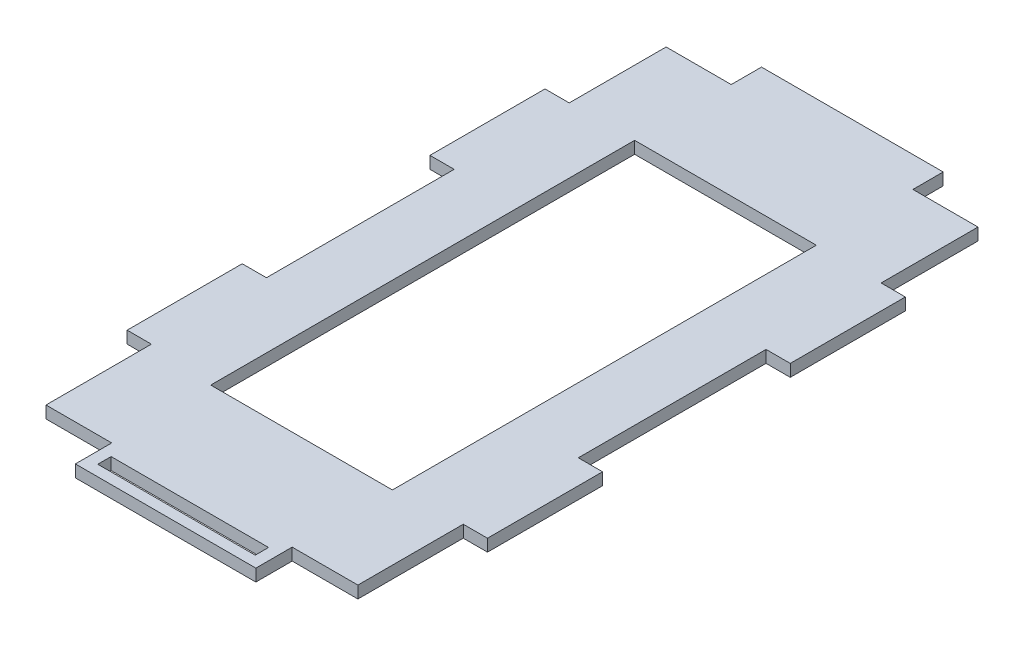
ISO-10303-21;
HEADER;
FILE_DESCRIPTION(('STEP AP214'),'2;1');
FILE_NAME('part.step','',(''),(''),'','','');
FILE_SCHEMA(('AUTOMOTIVE_DESIGN { 1 0 10303 214 1 1 1 1 }'));
ENDSEC;
DATA;
#1=APPLICATION_CONTEXT('core data for automotive mechanical design processes');
#2=APPLICATION_PROTOCOL_DEFINITION('international standard','automotive_design',2000,#1);
#3=PRODUCT_CONTEXT('',#1,'mechanical');
#4=PRODUCT('Part','Part','',(#3));
#5=PRODUCT_RELATED_PRODUCT_CATEGORY('part','',(#4));
#6=PRODUCT_DEFINITION_FORMATION('','',#4);
#7=PRODUCT_DEFINITION_CONTEXT('part definition',#1,'design');
#8=PRODUCT_DEFINITION('design','',#6,#7);
#9=PRODUCT_DEFINITION_SHAPE('','',#8);
#10=(LENGTH_UNIT() NAMED_UNIT(*) SI_UNIT(.MILLI.,.METRE.));
#11=(NAMED_UNIT(*) PLANE_ANGLE_UNIT() SI_UNIT($,.RADIAN.));
#12=(NAMED_UNIT(*) SI_UNIT($,.STERADIAN.) SOLID_ANGLE_UNIT());
#13=UNCERTAINTY_MEASURE_WITH_UNIT(LENGTH_MEASURE(1.E-05),#10,'distance_accuracy_value','');
#14=(GEOMETRIC_REPRESENTATION_CONTEXT(3) GLOBAL_UNCERTAINTY_ASSIGNED_CONTEXT((#13)) GLOBAL_UNIT_ASSIGNED_CONTEXT((#10,
#11,#12)) REPRESENTATION_CONTEXT('',''));
#15=CARTESIAN_POINT('',(0.,0.,0.));
#16=DIRECTION('',(0.,0.,1.));
#17=DIRECTION('',(1.,0.,0.));
#18=AXIS2_PLACEMENT_3D('',#15,#16,#17);
#19=CARTESIAN_POINT('',(-29.8,2.,-6.));
#20=DIRECTION('',(1.,0.,0.));
#21=DIRECTION('',(0.,0.,-1.));
#22=AXIS2_PLACEMENT_3D('',#19,#20,#21);
#23=PLANE('',#22);
#24=DIRECTION('',(0.,0.,1.));
#25=VECTOR('',#24,1.);
#26=CARTESIAN_POINT('',(-29.8,0.,-6.));
#27=LINE('',#26,#25);
#28=CARTESIAN_POINT('',(-29.8,0.,-6.));
#29=VERTEX_POINT('',#28);
#30=CARTESIAN_POINT('',(-29.8,0.,0.));
#31=VERTEX_POINT('',#30);
#32=EDGE_CURVE('E304',#29,#31,#27,.T.);
#33=ORIENTED_EDGE('',*,*,#32,.T.);
#34=DIRECTION('',(0.,-1.,0.));
#35=VECTOR('',#34,1.);
#36=CARTESIAN_POINT('',(-29.8,2.,0.));
#37=LINE('',#36,#35);
#38=CARTESIAN_POINT('',(-29.8,2.,0.));
#39=VERTEX_POINT('',#38);
#40=EDGE_CURVE('E11',#39,#31,#37,.T.);
#41=ORIENTED_EDGE('',*,*,#40,.F.);
#42=DIRECTION('',(0.,0.,1.));
#43=VECTOR('',#42,1.);
#44=CARTESIAN_POINT('',(-29.8,2.,-6.));
#45=LINE('',#44,#43);
#46=CARTESIAN_POINT('',(-29.8,2.,-6.));
#47=VERTEX_POINT('',#46);
#48=EDGE_CURVE('E333',#47,#39,#45,.T.);
#49=ORIENTED_EDGE('',*,*,#48,.F.);
#50=DIRECTION('',(0.,-1.,0.));
#51=VECTOR('',#50,1.);
#52=CARTESIAN_POINT('',(-29.8,2.,-6.));
#53=LINE('',#52,#51);
#54=EDGE_CURVE('E391',#47,#29,#53,.T.);
#55=ORIENTED_EDGE('',*,*,#54,.T.);
#56=EDGE_LOOP('',(#33,#41,#49,#55));
#57=FACE_BOUND('',#56,.T.);
#58=ADVANCED_FACE('F37',(#57),#23,.F.);
#59=CARTESIAN_POINT('',(-29.8,2.,0.));
#60=DIRECTION('',(0.,0.,-1.));
#61=DIRECTION('',(-1.,0.,0.));
#62=AXIS2_PLACEMENT_3D('',#59,#60,#61);
#63=PLANE('',#62);
#64=DIRECTION('',(1.,0.,0.));
#65=VECTOR('',#64,1.);
#66=CARTESIAN_POINT('',(-29.8,0.,0.));
#67=LINE('',#66,#65);
#68=CARTESIAN_POINT('',(0.,0.,0.));
#69=VERTEX_POINT('',#68);
#70=EDGE_CURVE('E394',#31,#69,#67,.T.);
#71=ORIENTED_EDGE('',*,*,#70,.T.);
#72=DIRECTION('',(0.,-1.,0.));
#73=VECTOR('',#72,1.);
#74=CARTESIAN_POINT('',(0.,2.,0.));
#75=LINE('',#74,#73);
#76=CARTESIAN_POINT('',(0.,2.,0.));
#77=VERTEX_POINT('',#76);
#78=EDGE_CURVE('E44',#77,#69,#75,.T.);
#79=ORIENTED_EDGE('',*,*,#78,.F.);
#80=DIRECTION('',(1.,0.,0.));
#81=VECTOR('',#80,1.);
#82=CARTESIAN_POINT('',(-29.8,2.,0.));
#83=LINE('',#82,#81);
#84=EDGE_CURVE('E336',#39,#77,#83,.T.);
#85=ORIENTED_EDGE('',*,*,#84,.F.);
#86=ORIENTED_EDGE('',*,*,#40,.T.);
#87=EDGE_LOOP('',(#71,#79,#85,#86));
#88=FACE_BOUND('',#87,.T.);
#89=ADVANCED_FACE('F550',(#88),#63,.F.);
#90=CARTESIAN_POINT('',(0.,2.,0.));
#91=DIRECTION('',(-1.,0.,0.));
#92=DIRECTION('',(0.,0.,1.));
#93=AXIS2_PLACEMENT_3D('',#90,#91,#92);
#94=PLANE('',#93);
#95=DIRECTION('',(0.,0.,-1.));
#96=VECTOR('',#95,1.);
#97=CARTESIAN_POINT('',(0.,0.,0.));
#98=LINE('',#97,#96);
#99=CARTESIAN_POINT('',(0.,0.,-6.));
#100=VERTEX_POINT('',#99);
#101=EDGE_CURVE('E396',#69,#100,#98,.T.);
#102=ORIENTED_EDGE('',*,*,#101,.T.);
#103=DIRECTION('',(0.,-1.,0.));
#104=VECTOR('',#103,1.);
#105=CARTESIAN_POINT('',(0.,2.,-6.));
#106=LINE('',#105,#104);
#107=CARTESIAN_POINT('',(0.,2.,-6.));
#108=VERTEX_POINT('',#107);
#109=EDGE_CURVE('E521',#108,#100,#106,.T.);
#110=ORIENTED_EDGE('',*,*,#109,.F.);
#111=DIRECTION('',(0.,0.,-1.));
#112=VECTOR('',#111,1.);
#113=CARTESIAN_POINT('',(0.,2.,0.));
#114=LINE('',#113,#112);
#115=EDGE_CURVE('E339',#77,#108,#114,.T.);
#116=ORIENTED_EDGE('',*,*,#115,.F.);
#117=ORIENTED_EDGE('',*,*,#78,.T.);
#118=EDGE_LOOP('',(#102,#110,#116,#117));
#119=FACE_BOUND('',#118,.T.);
#120=ADVANCED_FACE('F528',(#119),#94,.F.);
#121=CARTESIAN_POINT('',(0.,2.,-6.));
#122=DIRECTION('',(0.,0.,-1.));
#123=DIRECTION('',(-1.,0.,0.));
#124=AXIS2_PLACEMENT_3D('',#121,#122,#123);
#125=PLANE('',#124);
#126=DIRECTION('',(1.,0.,0.));
#127=VECTOR('',#126,1.);
#128=CARTESIAN_POINT('',(0.,0.,-6.));
#129=LINE('',#128,#127);
#130=CARTESIAN_POINT('',(10.85,0.,-6.));
#131=VERTEX_POINT('',#130);
#132=EDGE_CURVE('E398',#100,#131,#129,.T.);
#133=ORIENTED_EDGE('',*,*,#132,.T.);
#134=DIRECTION('',(0.,-1.,0.));
#135=VECTOR('',#134,1.);
#136=CARTESIAN_POINT('',(10.85,2.,-6.));
#137=LINE('',#136,#135);
#138=CARTESIAN_POINT('',(10.85,2.,-6.));
#139=VERTEX_POINT('',#138);
#140=EDGE_CURVE('E518',#139,#131,#137,.T.);
#141=ORIENTED_EDGE('',*,*,#140,.F.);
#142=DIRECTION('',(1.,0.,0.));
#143=VECTOR('',#142,1.);
#144=CARTESIAN_POINT('',(0.,2.,-6.));
#145=LINE('',#144,#143);
#146=EDGE_CURVE('E341',#108,#139,#145,.T.);
#147=ORIENTED_EDGE('',*,*,#146,.F.);
#148=ORIENTED_EDGE('',*,*,#109,.T.);
#149=EDGE_LOOP('',(#133,#141,#147,#148));
#150=FACE_BOUND('',#149,.T.);
#151=ADVANCED_FACE('F539',(#150),#125,.F.);
#152=CARTESIAN_POINT('',(10.85,2.,-6.));
#153=DIRECTION('',(-1.,0.,0.));
#154=DIRECTION('',(0.,0.,1.));
#155=AXIS2_PLACEMENT_3D('',#152,#153,#154);
#156=PLANE('',#155);
#157=DIRECTION('',(0.,0.,-1.));
#158=VECTOR('',#157,1.);
#159=CARTESIAN_POINT('',(10.85,0.,-6.));
#160=LINE('',#159,#158);
#161=CARTESIAN_POINT('',(10.85,0.,-23.4));
#162=VERTEX_POINT('',#161);
#163=EDGE_CURVE('E400',#131,#162,#160,.T.);
#164=ORIENTED_EDGE('',*,*,#163,.T.);
#165=DIRECTION('',(0.,-1.,0.));
#166=VECTOR('',#165,1.);
#167=CARTESIAN_POINT('',(10.85,2.,-23.4));
#168=LINE('',#167,#166);
#169=CARTESIAN_POINT('',(10.85,2.,-23.4));
#170=VERTEX_POINT('',#169);
#171=EDGE_CURVE('E515',#170,#162,#168,.T.);
#172=ORIENTED_EDGE('',*,*,#171,.F.);
#173=DIRECTION('',(0.,0.,-1.));
#174=VECTOR('',#173,1.);
#175=CARTESIAN_POINT('',(10.85,2.,-6.));
#176=LINE('',#175,#174);
#177=EDGE_CURVE('E343',#139,#170,#176,.T.);
#178=ORIENTED_EDGE('',*,*,#177,.F.);
#179=ORIENTED_EDGE('',*,*,#140,.T.);
#180=EDGE_LOOP('',(#164,#172,#178,#179));
#181=FACE_BOUND('',#180,.T.);
#182=ADVANCED_FACE('F543',(#181),#156,.F.);
#183=CARTESIAN_POINT('',(10.85,2.,-23.4));
#184=DIRECTION('',(0.,0.,-1.));
#185=DIRECTION('',(-1.,0.,0.));
#186=AXIS2_PLACEMENT_3D('',#183,#184,#185);
#187=PLANE('',#186);
#188=DIRECTION('',(1.,0.,0.));
#189=VECTOR('',#188,1.);
#190=CARTESIAN_POINT('',(10.85,0.,-23.4));
#191=LINE('',#190,#189);
#192=CARTESIAN_POINT('',(14.85,0.,-23.4));
#193=VERTEX_POINT('',#192);
#194=EDGE_CURVE('E402',#162,#193,#191,.T.);
#195=ORIENTED_EDGE('',*,*,#194,.T.);
#196=DIRECTION('',(0.,-1.,0.));
#197=VECTOR('',#196,1.);
#198=CARTESIAN_POINT('',(14.85,2.,-23.4));
#199=LINE('',#198,#197);
#200=CARTESIAN_POINT('',(14.85,2.,-23.4));
#201=VERTEX_POINT('',#200);
#202=EDGE_CURVE('E512',#201,#193,#199,.T.);
#203=ORIENTED_EDGE('',*,*,#202,.F.);
#204=DIRECTION('',(1.,0.,0.));
#205=VECTOR('',#204,1.);
#206=CARTESIAN_POINT('',(10.85,2.,-23.4));
#207=LINE('',#206,#205);
#208=EDGE_CURVE('E345',#170,#201,#207,.T.);
#209=ORIENTED_EDGE('',*,*,#208,.F.);
#210=ORIENTED_EDGE('',*,*,#171,.T.);
#211=EDGE_LOOP('',(#195,#203,#209,#210));
#212=FACE_BOUND('',#211,.T.);
#213=ADVANCED_FACE('F663',(#212),#187,.F.);
#214=CARTESIAN_POINT('',(14.85,2.,-23.4));
#215=DIRECTION('',(-1.,0.,0.));
#216=DIRECTION('',(0.,0.,1.));
#217=AXIS2_PLACEMENT_3D('',#214,#215,#216);
#218=PLANE('',#217);
#219=DIRECTION('',(0.,0.,-1.));
#220=VECTOR('',#219,1.);
#221=CARTESIAN_POINT('',(14.85,0.,-23.4));
#222=LINE('',#221,#220);
#223=CARTESIAN_POINT('',(14.85,0.,-42.4));
#224=VERTEX_POINT('',#223);
#225=EDGE_CURVE('E404',#193,#224,#222,.T.);
#226=ORIENTED_EDGE('',*,*,#225,.T.);
#227=DIRECTION('',(0.,-1.,0.));
#228=VECTOR('',#227,1.);
#229=CARTESIAN_POINT('',(14.85,2.,-42.4));
#230=LINE('',#229,#228);
#231=CARTESIAN_POINT('',(14.85,2.,-42.4));
#232=VERTEX_POINT('',#231);
#233=EDGE_CURVE('E509',#232,#224,#230,.T.);
#234=ORIENTED_EDGE('',*,*,#233,.F.);
#235=DIRECTION('',(0.,0.,-1.));
#236=VECTOR('',#235,1.);
#237=CARTESIAN_POINT('',(14.85,2.,-23.4));
#238=LINE('',#237,#236);
#239=EDGE_CURVE('E347',#201,#232,#238,.T.);
#240=ORIENTED_EDGE('',*,*,#239,.F.);
#241=ORIENTED_EDGE('',*,*,#202,.T.);
#242=EDGE_LOOP('',(#226,#234,#240,#241));
#243=FACE_BOUND('',#242,.T.);
#244=ADVANCED_FACE('F660',(#243),#218,.F.);
#245=CARTESIAN_POINT('',(14.85,2.,-42.4));
#246=DIRECTION('',(0.,0.,1.));
#247=DIRECTION('',(1.,0.,0.));
#248=AXIS2_PLACEMENT_3D('',#245,#246,#247);
#249=PLANE('',#248);
#250=DIRECTION('',(-1.,0.,0.));
#251=VECTOR('',#250,1.);
#252=CARTESIAN_POINT('',(14.85,0.,-42.4));
#253=LINE('',#252,#251);
#254=CARTESIAN_POINT('',(10.85,0.,-42.4));
#255=VERTEX_POINT('',#254);
#256=EDGE_CURVE('E406',#224,#255,#253,.T.);
#257=ORIENTED_EDGE('',*,*,#256,.T.);
#258=DIRECTION('',(0.,-1.,0.));
#259=VECTOR('',#258,1.);
#260=CARTESIAN_POINT('',(10.85,2.,-42.4));
#261=LINE('',#260,#259);
#262=CARTESIAN_POINT('',(10.85,2.,-42.4));
#263=VERTEX_POINT('',#262);
#264=EDGE_CURVE('E506',#263,#255,#261,.T.);
#265=ORIENTED_EDGE('',*,*,#264,.F.);
#266=DIRECTION('',(-1.,0.,0.));
#267=VECTOR('',#266,1.);
#268=CARTESIAN_POINT('',(14.85,2.,-42.4));
#269=LINE('',#268,#267);
#270=EDGE_CURVE('E349',#232,#263,#269,.T.);
#271=ORIENTED_EDGE('',*,*,#270,.F.);
#272=ORIENTED_EDGE('',*,*,#233,.T.);
#273=EDGE_LOOP('',(#257,#265,#271,#272));
#274=FACE_BOUND('',#273,.T.);
#275=ADVANCED_FACE('F656',(#274),#249,.F.);
#276=CARTESIAN_POINT('',(10.85,2.,-42.4));
#277=DIRECTION('',(-1.,0.,0.));
#278=DIRECTION('',(0.,0.,1.));
#279=AXIS2_PLACEMENT_3D('',#276,#277,#278);
#280=PLANE('',#279);
#281=DIRECTION('',(0.,0.,-1.));
#282=VECTOR('',#281,1.);
#283=CARTESIAN_POINT('',(10.85,0.,-42.4));
#284=LINE('',#283,#282);
#285=CARTESIAN_POINT('',(10.85,0.,-73.4));
#286=VERTEX_POINT('',#285);
#287=EDGE_CURVE('E408',#255,#286,#284,.T.);
#288=ORIENTED_EDGE('',*,*,#287,.T.);
#289=DIRECTION('',(0.,-1.,0.));
#290=VECTOR('',#289,1.);
#291=CARTESIAN_POINT('',(10.85,2.,-73.4));
#292=LINE('',#291,#290);
#293=CARTESIAN_POINT('',(10.85,2.,-73.4));
#294=VERTEX_POINT('',#293);
#295=EDGE_CURVE('E503',#294,#286,#292,.T.);
#296=ORIENTED_EDGE('',*,*,#295,.F.);
#297=DIRECTION('',(0.,0.,-1.));
#298=VECTOR('',#297,1.);
#299=CARTESIAN_POINT('',(10.85,2.,-42.4));
#300=LINE('',#299,#298);
#301=EDGE_CURVE('E351',#263,#294,#300,.T.);
#302=ORIENTED_EDGE('',*,*,#301,.F.);
#303=ORIENTED_EDGE('',*,*,#264,.T.);
#304=EDGE_LOOP('',(#288,#296,#302,#303));
#305=FACE_BOUND('',#304,.T.);
#306=ADVANCED_FACE('F652',(#305),#280,.F.);
#307=CARTESIAN_POINT('',(10.85,2.,-73.4));
#308=DIRECTION('',(0.,0.,-1.));
#309=DIRECTION('',(-1.,0.,0.));
#310=AXIS2_PLACEMENT_3D('',#307,#308,#309);
#311=PLANE('',#310);
#312=DIRECTION('',(1.,0.,0.));
#313=VECTOR('',#312,1.);
#314=CARTESIAN_POINT('',(10.85,0.,-73.4));
#315=LINE('',#314,#313);
#316=CARTESIAN_POINT('',(14.85,0.,-73.4));
#317=VERTEX_POINT('',#316);
#318=EDGE_CURVE('E410',#286,#317,#315,.T.);
#319=ORIENTED_EDGE('',*,*,#318,.T.);
#320=DIRECTION('',(0.,-1.,0.));
#321=VECTOR('',#320,1.);
#322=CARTESIAN_POINT('',(14.85,2.,-73.4));
#323=LINE('',#322,#321);
#324=CARTESIAN_POINT('',(14.85,2.,-73.4));
#325=VERTEX_POINT('',#324);
#326=EDGE_CURVE('E500',#325,#317,#323,.T.);
#327=ORIENTED_EDGE('',*,*,#326,.F.);
#328=DIRECTION('',(1.,0.,0.));
#329=VECTOR('',#328,1.);
#330=CARTESIAN_POINT('',(10.85,2.,-73.4));
#331=LINE('',#330,#329);
#332=EDGE_CURVE('E353',#294,#325,#331,.T.);
#333=ORIENTED_EDGE('',*,*,#332,.F.);
#334=ORIENTED_EDGE('',*,*,#295,.T.);
#335=EDGE_LOOP('',(#319,#327,#333,#334));
#336=FACE_BOUND('',#335,.T.);
#337=ADVANCED_FACE('F647',(#336),#311,.F.);
#338=CARTESIAN_POINT('',(14.85,2.,-73.4));
#339=DIRECTION('',(-1.,0.,0.));
#340=DIRECTION('',(0.,0.,1.));
#341=AXIS2_PLACEMENT_3D('',#338,#339,#340);
#342=PLANE('',#341);
#343=DIRECTION('',(0.,0.,-1.));
#344=VECTOR('',#343,1.);
#345=CARTESIAN_POINT('',(14.85,0.,-73.4));
#346=LINE('',#345,#344);
#347=CARTESIAN_POINT('',(14.85,0.,-92.4));
#348=VERTEX_POINT('',#347);
#349=EDGE_CURVE('E412',#317,#348,#346,.T.);
#350=ORIENTED_EDGE('',*,*,#349,.T.);
#351=DIRECTION('',(0.,-1.,0.));
#352=VECTOR('',#351,1.);
#353=CARTESIAN_POINT('',(14.85,2.,-92.4));
#354=LINE('',#353,#352);
#355=CARTESIAN_POINT('',(14.85,2.,-92.4));
#356=VERTEX_POINT('',#355);
#357=EDGE_CURVE('E497',#356,#348,#354,.T.);
#358=ORIENTED_EDGE('',*,*,#357,.F.);
#359=DIRECTION('',(0.,0.,-1.));
#360=VECTOR('',#359,1.);
#361=CARTESIAN_POINT('',(14.85,2.,-73.4));
#362=LINE('',#361,#360);
#363=EDGE_CURVE('E355',#325,#356,#362,.T.);
#364=ORIENTED_EDGE('',*,*,#363,.F.);
#365=ORIENTED_EDGE('',*,*,#326,.T.);
#366=EDGE_LOOP('',(#350,#358,#364,#365));
#367=FACE_BOUND('',#366,.T.);
#368=ADVANCED_FACE('F641',(#367),#342,.F.);
#369=CARTESIAN_POINT('',(14.85,2.,-92.4));
#370=DIRECTION('',(0.,0.,1.));
#371=DIRECTION('',(1.,0.,0.));
#372=AXIS2_PLACEMENT_3D('',#369,#370,#371);
#373=PLANE('',#372);
#374=DIRECTION('',(-1.,0.,0.));
#375=VECTOR('',#374,1.);
#376=CARTESIAN_POINT('',(14.85,0.,-92.4));
#377=LINE('',#376,#375);
#378=CARTESIAN_POINT('',(10.85,0.,-92.4));
#379=VERTEX_POINT('',#378);
#380=EDGE_CURVE('E414',#348,#379,#377,.T.);
#381=ORIENTED_EDGE('',*,*,#380,.T.);
#382=DIRECTION('',(0.,-1.,0.));
#383=VECTOR('',#382,1.);
#384=CARTESIAN_POINT('',(10.85,2.,-92.4));
#385=LINE('',#384,#383);
#386=CARTESIAN_POINT('',(10.85,2.,-92.4));
#387=VERTEX_POINT('',#386);
#388=EDGE_CURVE('E494',#387,#379,#385,.T.);
#389=ORIENTED_EDGE('',*,*,#388,.F.);
#390=DIRECTION('',(-1.,0.,0.));
#391=VECTOR('',#390,1.);
#392=CARTESIAN_POINT('',(14.85,2.,-92.4));
#393=LINE('',#392,#391);
#394=EDGE_CURVE('E357',#356,#387,#393,.T.);
#395=ORIENTED_EDGE('',*,*,#394,.F.);
#396=ORIENTED_EDGE('',*,*,#357,.T.);
#397=EDGE_LOOP('',(#381,#389,#395,#396));
#398=FACE_BOUND('',#397,.T.);
#399=ADVANCED_FACE('F637',(#398),#373,.F.);
#400=CARTESIAN_POINT('',(10.85,2.,-92.4));
#401=DIRECTION('',(-1.,0.,0.));
#402=DIRECTION('',(0.,0.,1.));
#403=AXIS2_PLACEMENT_3D('',#400,#401,#402);
#404=PLANE('',#403);
#405=DIRECTION('',(0.,0.,-1.));
#406=VECTOR('',#405,1.);
#407=CARTESIAN_POINT('',(10.85,0.,-92.4));
#408=LINE('',#407,#406);
#409=CARTESIAN_POINT('',(10.85,0.,-108.4));
#410=VERTEX_POINT('',#409);
#411=EDGE_CURVE('E416',#379,#410,#408,.T.);
#412=ORIENTED_EDGE('',*,*,#411,.T.);
#413=DIRECTION('',(0.,-1.,0.));
#414=VECTOR('',#413,1.);
#415=CARTESIAN_POINT('',(10.85,2.,-108.4));
#416=LINE('',#415,#414);
#417=CARTESIAN_POINT('',(10.85,2.,-108.4));
#418=VERTEX_POINT('',#417);
#419=EDGE_CURVE('E491',#418,#410,#416,.T.);
#420=ORIENTED_EDGE('',*,*,#419,.F.);
#421=DIRECTION('',(0.,0.,-1.));
#422=VECTOR('',#421,1.);
#423=CARTESIAN_POINT('',(10.85,2.,-92.4));
#424=LINE('',#423,#422);
#425=EDGE_CURVE('E359',#387,#418,#424,.T.);
#426=ORIENTED_EDGE('',*,*,#425,.F.);
#427=ORIENTED_EDGE('',*,*,#388,.T.);
#428=EDGE_LOOP('',(#412,#420,#426,#427));
#429=FACE_BOUND('',#428,.T.);
#430=ADVANCED_FACE('F632',(#429),#404,.F.);
#431=CARTESIAN_POINT('',(0.0999999999999925,2.,-108.4));
#432=DIRECTION('',(0.,0.,1.));
#433=DIRECTION('',(1.,0.,0.));
#434=AXIS2_PLACEMENT_3D('',#431,#432,#433);
#435=PLANE('',#434);
#436=DIRECTION('',(-1.,0.,0.));
#437=VECTOR('',#436,1.);
#438=CARTESIAN_POINT('',(0.0999999999999925,0.,-108.4));
#439=LINE('',#438,#437);
#440=CARTESIAN_POINT('',(0.0999999999999925,0.,-108.4));
#441=VERTEX_POINT('',#440);
#442=EDGE_CURVE('E418',#410,#441,#439,.T.);
#443=ORIENTED_EDGE('',*,*,#442,.T.);
#444=DIRECTION('',(0.,-1.,0.));
#445=VECTOR('',#444,1.);
#446=CARTESIAN_POINT('',(0.0999999999999925,2.,-108.4));
#447=LINE('',#446,#445);
#448=CARTESIAN_POINT('',(0.0999999999999925,2.,-108.4));
#449=VERTEX_POINT('',#448);
#450=EDGE_CURVE('E488',#449,#441,#447,.T.);
#451=ORIENTED_EDGE('',*,*,#450,.F.);
#452=DIRECTION('',(-1.,0.,0.));
#453=VECTOR('',#452,1.);
#454=CARTESIAN_POINT('',(0.0999999999999925,2.,-108.4));
#455=LINE('',#454,#453);
#456=EDGE_CURVE('E361',#418,#449,#455,.T.);
#457=ORIENTED_EDGE('',*,*,#456,.F.);
#458=ORIENTED_EDGE('',*,*,#419,.T.);
#459=EDGE_LOOP('',(#443,#451,#457,#458));
#460=FACE_BOUND('',#459,.T.);
#461=ADVANCED_FACE('F626',(#460),#435,.F.);
#462=CARTESIAN_POINT('',(0.0999999999999925,2.,-108.4));
#463=DIRECTION('',(-1.,0.,0.));
#464=DIRECTION('',(0.,0.,1.));
#465=AXIS2_PLACEMENT_3D('',#462,#463,#464);
#466=PLANE('',#465);
#467=DIRECTION('',(0.,0.,-1.));
#468=VECTOR('',#467,1.);
#469=CARTESIAN_POINT('',(0.0999999999999925,0.,-108.4));
#470=LINE('',#469,#468);
#471=CARTESIAN_POINT('',(0.0999999999999925,0.,-113.4));
#472=VERTEX_POINT('',#471);
#473=EDGE_CURVE('E420',#441,#472,#470,.T.);
#474=ORIENTED_EDGE('',*,*,#473,.T.);
#475=DIRECTION('',(0.,-1.,0.));
#476=VECTOR('',#475,1.);
#477=CARTESIAN_POINT('',(0.0999999999999925,2.,-113.4));
#478=LINE('',#477,#476);
#479=CARTESIAN_POINT('',(0.0999999999999925,2.,-113.4));
#480=VERTEX_POINT('',#479);
#481=EDGE_CURVE('E485',#480,#472,#478,.T.);
#482=ORIENTED_EDGE('',*,*,#481,.F.);
#483=DIRECTION('',(0.,0.,-1.));
#484=VECTOR('',#483,1.);
#485=CARTESIAN_POINT('',(0.0999999999999925,2.,-108.4));
#486=LINE('',#485,#484);
#487=EDGE_CURVE('E363',#449,#480,#486,.T.);
#488=ORIENTED_EDGE('',*,*,#487,.F.);
#489=ORIENTED_EDGE('',*,*,#450,.T.);
#490=EDGE_LOOP('',(#474,#482,#488,#489));
#491=FACE_BOUND('',#490,.T.);
#492=ADVANCED_FACE('F622',(#491),#466,.F.);
#493=CARTESIAN_POINT('',(-29.9,2.,-113.4));
#494=DIRECTION('',(0.,0.,1.));
#495=DIRECTION('',(1.,0.,0.));
#496=AXIS2_PLACEMENT_3D('',#493,#494,#495);
#497=PLANE('',#496);
#498=DIRECTION('',(-1.,0.,0.));
#499=VECTOR('',#498,1.);
#500=CARTESIAN_POINT('',(-29.9,0.,-113.4));
#501=LINE('',#500,#499);
#502=CARTESIAN_POINT('',(-29.9,0.,-113.4));
#503=VERTEX_POINT('',#502);
#504=EDGE_CURVE('E422',#472,#503,#501,.T.);
#505=ORIENTED_EDGE('',*,*,#504,.T.);
#506=DIRECTION('',(0.,-1.,0.));
#507=VECTOR('',#506,1.);
#508=CARTESIAN_POINT('',(-29.9,2.,-113.4));
#509=LINE('',#508,#507);
#510=CARTESIAN_POINT('',(-29.9,2.,-113.4));
#511=VERTEX_POINT('',#510);
#512=EDGE_CURVE('E482',#511,#503,#509,.T.);
#513=ORIENTED_EDGE('',*,*,#512,.F.);
#514=DIRECTION('',(-1.,0.,0.));
#515=VECTOR('',#514,1.);
#516=CARTESIAN_POINT('',(-29.9,2.,-113.4));
#517=LINE('',#516,#515);
#518=EDGE_CURVE('E365',#480,#511,#517,.T.);
#519=ORIENTED_EDGE('',*,*,#518,.F.);
#520=ORIENTED_EDGE('',*,*,#481,.T.);
#521=EDGE_LOOP('',(#505,#513,#519,#520));
#522=FACE_BOUND('',#521,.T.);
#523=ADVANCED_FACE('F617',(#522),#497,.F.);
#524=CARTESIAN_POINT('',(-29.9,2.,-108.4));
#525=DIRECTION('',(1.,0.,0.));
#526=DIRECTION('',(0.,0.,-1.));
#527=AXIS2_PLACEMENT_3D('',#524,#525,#526);
#528=PLANE('',#527);
#529=DIRECTION('',(0.,0.,1.));
#530=VECTOR('',#529,1.);
#531=CARTESIAN_POINT('',(-29.9,0.,-108.4));
#532=LINE('',#531,#530);
#533=CARTESIAN_POINT('',(-29.9,0.,-108.4));
#534=VERTEX_POINT('',#533);
#535=EDGE_CURVE('E424',#503,#534,#532,.T.);
#536=ORIENTED_EDGE('',*,*,#535,.T.);
#537=DIRECTION('',(0.,-1.,0.));
#538=VECTOR('',#537,1.);
#539=CARTESIAN_POINT('',(-29.9,2.,-108.4));
#540=LINE('',#539,#538);
#541=CARTESIAN_POINT('',(-29.9,2.,-108.4));
#542=VERTEX_POINT('',#541);
#543=EDGE_CURVE('E479',#542,#534,#540,.T.);
#544=ORIENTED_EDGE('',*,*,#543,.F.);
#545=DIRECTION('',(0.,0.,1.));
#546=VECTOR('',#545,1.);
#547=CARTESIAN_POINT('',(-29.9,2.,-108.4));
#548=LINE('',#547,#546);
#549=EDGE_CURVE('E367',#511,#542,#548,.T.);
#550=ORIENTED_EDGE('',*,*,#549,.F.);
#551=ORIENTED_EDGE('',*,*,#512,.T.);
#552=EDGE_LOOP('',(#536,#544,#550,#551));
#553=FACE_BOUND('',#552,.T.);
#554=ADVANCED_FACE('F611',(#553),#528,.F.);
#555=CARTESIAN_POINT('',(-40.65,2.,-108.4));
#556=DIRECTION('',(0.,0.,1.));
#557=DIRECTION('',(1.,0.,0.));
#558=AXIS2_PLACEMENT_3D('',#555,#556,#557);
#559=PLANE('',#558);
#560=DIRECTION('',(-1.,0.,0.));
#561=VECTOR('',#560,1.);
#562=CARTESIAN_POINT('',(-40.65,0.,-108.4));
#563=LINE('',#562,#561);
#564=CARTESIAN_POINT('',(-40.65,0.,-108.4));
#565=VERTEX_POINT('',#564);
#566=EDGE_CURVE('E426',#534,#565,#563,.T.);
#567=ORIENTED_EDGE('',*,*,#566,.T.);
#568=DIRECTION('',(0.,-1.,0.));
#569=VECTOR('',#568,1.);
#570=CARTESIAN_POINT('',(-40.65,2.,-108.4));
#571=LINE('',#570,#569);
#572=CARTESIAN_POINT('',(-40.65,2.,-108.4));
#573=VERTEX_POINT('',#572);
#574=EDGE_CURVE('E476',#573,#565,#571,.T.);
#575=ORIENTED_EDGE('',*,*,#574,.F.);
#576=DIRECTION('',(-1.,0.,0.));
#577=VECTOR('',#576,1.);
#578=CARTESIAN_POINT('',(-40.65,2.,-108.4));
#579=LINE('',#578,#577);
#580=EDGE_CURVE('E369',#542,#573,#579,.T.);
#581=ORIENTED_EDGE('',*,*,#580,.F.);
#582=ORIENTED_EDGE('',*,*,#543,.T.);
#583=EDGE_LOOP('',(#567,#575,#581,#582));
#584=FACE_BOUND('',#583,.T.);
#585=ADVANCED_FACE('F607',(#584),#559,.F.);
#586=CARTESIAN_POINT('',(-40.65,2.,-108.4));
#587=DIRECTION('',(1.,0.,0.));
#588=DIRECTION('',(0.,0.,-1.));
#589=AXIS2_PLACEMENT_3D('',#586,#587,#588);
#590=PLANE('',#589);
#591=DIRECTION('',(0.,0.,1.));
#592=VECTOR('',#591,1.);
#593=CARTESIAN_POINT('',(-40.65,0.,-108.4));
#594=LINE('',#593,#592);
#595=CARTESIAN_POINT('',(-40.65,0.,-92.4));
#596=VERTEX_POINT('',#595);
#597=EDGE_CURVE('E428',#565,#596,#594,.T.);
#598=ORIENTED_EDGE('',*,*,#597,.T.);
#599=DIRECTION('',(0.,-1.,0.));
#600=VECTOR('',#599,1.);
#601=CARTESIAN_POINT('',(-40.65,2.,-92.4));
#602=LINE('',#601,#600);
#603=CARTESIAN_POINT('',(-40.65,2.,-92.4));
#604=VERTEX_POINT('',#603);
#605=EDGE_CURVE('E473',#604,#596,#602,.T.);
#606=ORIENTED_EDGE('',*,*,#605,.F.);
#607=DIRECTION('',(0.,0.,1.));
#608=VECTOR('',#607,1.);
#609=CARTESIAN_POINT('',(-40.65,2.,-108.4));
#610=LINE('',#609,#608);
#611=EDGE_CURVE('E371',#573,#604,#610,.T.);
#612=ORIENTED_EDGE('',*,*,#611,.F.);
#613=ORIENTED_EDGE('',*,*,#574,.T.);
#614=EDGE_LOOP('',(#598,#606,#612,#613));
#615=FACE_BOUND('',#614,.T.);
#616=ADVANCED_FACE('F602',(#615),#590,.F.);
#617=CARTESIAN_POINT('',(-40.65,2.,-92.4));
#618=DIRECTION('',(0.,0.,1.));
#619=DIRECTION('',(1.,0.,0.));
#620=AXIS2_PLACEMENT_3D('',#617,#618,#619);
#621=PLANE('',#620);
#622=DIRECTION('',(-1.,0.,0.));
#623=VECTOR('',#622,1.);
#624=CARTESIAN_POINT('',(-40.65,0.,-92.4));
#625=LINE('',#624,#623);
#626=CARTESIAN_POINT('',(-44.65,0.,-92.4));
#627=VERTEX_POINT('',#626);
#628=EDGE_CURVE('E430',#596,#627,#625,.T.);
#629=ORIENTED_EDGE('',*,*,#628,.T.);
#630=DIRECTION('',(0.,-1.,0.));
#631=VECTOR('',#630,1.);
#632=CARTESIAN_POINT('',(-44.65,2.,-92.4));
#633=LINE('',#632,#631);
#634=CARTESIAN_POINT('',(-44.65,2.,-92.4));
#635=VERTEX_POINT('',#634);
#636=EDGE_CURVE('E470',#635,#627,#633,.T.);
#637=ORIENTED_EDGE('',*,*,#636,.F.);
#638=DIRECTION('',(-1.,0.,0.));
#639=VECTOR('',#638,1.);
#640=CARTESIAN_POINT('',(-40.65,2.,-92.4));
#641=LINE('',#640,#639);
#642=EDGE_CURVE('E373',#604,#635,#641,.T.);
#643=ORIENTED_EDGE('',*,*,#642,.F.);
#644=ORIENTED_EDGE('',*,*,#605,.T.);
#645=EDGE_LOOP('',(#629,#637,#643,#644));
#646=FACE_BOUND('',#645,.T.);
#647=ADVANCED_FACE('F596',(#646),#621,.F.);
#648=CARTESIAN_POINT('',(-44.65,2.,-92.4));
#649=DIRECTION('',(1.,0.,0.));
#650=DIRECTION('',(0.,0.,-1.));
#651=AXIS2_PLACEMENT_3D('',#648,#649,#650);
#652=PLANE('',#651);
#653=DIRECTION('',(0.,0.,1.));
#654=VECTOR('',#653,1.);
#655=CARTESIAN_POINT('',(-44.65,0.,-92.4));
#656=LINE('',#655,#654);
#657=CARTESIAN_POINT('',(-44.65,0.,-73.4));
#658=VERTEX_POINT('',#657);
#659=EDGE_CURVE('E432',#627,#658,#656,.T.);
#660=ORIENTED_EDGE('',*,*,#659,.T.);
#661=DIRECTION('',(0.,-1.,0.));
#662=VECTOR('',#661,1.);
#663=CARTESIAN_POINT('',(-44.65,2.,-73.4));
#664=LINE('',#663,#662);
#665=CARTESIAN_POINT('',(-44.65,2.,-73.4));
#666=VERTEX_POINT('',#665);
#667=EDGE_CURVE('E467',#666,#658,#664,.T.);
#668=ORIENTED_EDGE('',*,*,#667,.F.);
#669=DIRECTION('',(0.,0.,1.));
#670=VECTOR('',#669,1.);
#671=CARTESIAN_POINT('',(-44.65,2.,-92.4));
#672=LINE('',#671,#670);
#673=EDGE_CURVE('E375',#635,#666,#672,.T.);
#674=ORIENTED_EDGE('',*,*,#673,.F.);
#675=ORIENTED_EDGE('',*,*,#636,.T.);
#676=EDGE_LOOP('',(#660,#668,#674,#675));
#677=FACE_BOUND('',#676,.T.);
#678=ADVANCED_FACE('F592',(#677),#652,.F.);
#679=CARTESIAN_POINT('',(-44.65,2.,-73.4));
#680=DIRECTION('',(0.,0.,-1.));
#681=DIRECTION('',(-1.,0.,0.));
#682=AXIS2_PLACEMENT_3D('',#679,#680,#681);
#683=PLANE('',#682);
#684=DIRECTION('',(1.,0.,0.));
#685=VECTOR('',#684,1.);
#686=CARTESIAN_POINT('',(-44.65,0.,-73.4));
#687=LINE('',#686,#685);
#688=CARTESIAN_POINT('',(-40.65,0.,-73.4));
#689=VERTEX_POINT('',#688);
#690=EDGE_CURVE('E434',#658,#689,#687,.T.);
#691=ORIENTED_EDGE('',*,*,#690,.T.);
#692=DIRECTION('',(0.,-1.,0.));
#693=VECTOR('',#692,1.);
#694=CARTESIAN_POINT('',(-40.65,2.,-73.4));
#695=LINE('',#694,#693);
#696=CARTESIAN_POINT('',(-40.65,2.,-73.4));
#697=VERTEX_POINT('',#696);
#698=EDGE_CURVE('E464',#697,#689,#695,.T.);
#699=ORIENTED_EDGE('',*,*,#698,.F.);
#700=DIRECTION('',(1.,0.,0.));
#701=VECTOR('',#700,1.);
#702=CARTESIAN_POINT('',(-44.65,2.,-73.4));
#703=LINE('',#702,#701);
#704=EDGE_CURVE('E377',#666,#697,#703,.T.);
#705=ORIENTED_EDGE('',*,*,#704,.F.);
#706=ORIENTED_EDGE('',*,*,#667,.T.);
#707=EDGE_LOOP('',(#691,#699,#705,#706));
#708=FACE_BOUND('',#707,.T.);
#709=ADVANCED_FACE('F587',(#708),#683,.F.);
#710=CARTESIAN_POINT('',(-40.65,2.,-73.4));
#711=DIRECTION('',(1.,0.,0.));
#712=DIRECTION('',(0.,0.,-1.));
#713=AXIS2_PLACEMENT_3D('',#710,#711,#712);
#714=PLANE('',#713);
#715=DIRECTION('',(0.,0.,1.));
#716=VECTOR('',#715,1.);
#717=CARTESIAN_POINT('',(-40.65,0.,-73.4));
#718=LINE('',#717,#716);
#719=CARTESIAN_POINT('',(-40.65,0.,-42.4));
#720=VERTEX_POINT('',#719);
#721=EDGE_CURVE('E436',#689,#720,#718,.T.);
#722=ORIENTED_EDGE('',*,*,#721,.T.);
#723=DIRECTION('',(0.,-1.,0.));
#724=VECTOR('',#723,1.);
#725=CARTESIAN_POINT('',(-40.65,2.,-42.4));
#726=LINE('',#725,#724);
#727=CARTESIAN_POINT('',(-40.65,2.,-42.4));
#728=VERTEX_POINT('',#727);
#729=EDGE_CURVE('E461',#728,#720,#726,.T.);
#730=ORIENTED_EDGE('',*,*,#729,.F.);
#731=DIRECTION('',(0.,0.,1.));
#732=VECTOR('',#731,1.);
#733=CARTESIAN_POINT('',(-40.65,2.,-73.4));
#734=LINE('',#733,#732);
#735=EDGE_CURVE('E379',#697,#728,#734,.T.);
#736=ORIENTED_EDGE('',*,*,#735,.F.);
#737=ORIENTED_EDGE('',*,*,#698,.T.);
#738=EDGE_LOOP('',(#722,#730,#736,#737));
#739=FACE_BOUND('',#738,.T.);
#740=ADVANCED_FACE('F581',(#739),#714,.F.);
#741=CARTESIAN_POINT('',(-40.65,2.,-42.4));
#742=DIRECTION('',(0.,0.,1.));
#743=DIRECTION('',(1.,0.,0.));
#744=AXIS2_PLACEMENT_3D('',#741,#742,#743);
#745=PLANE('',#744);
#746=DIRECTION('',(-1.,0.,0.));
#747=VECTOR('',#746,1.);
#748=CARTESIAN_POINT('',(-40.65,0.,-42.4));
#749=LINE('',#748,#747);
#750=CARTESIAN_POINT('',(-44.65,0.,-42.4));
#751=VERTEX_POINT('',#750);
#752=EDGE_CURVE('E438',#720,#751,#749,.T.);
#753=ORIENTED_EDGE('',*,*,#752,.T.);
#754=DIRECTION('',(0.,-1.,0.));
#755=VECTOR('',#754,1.);
#756=CARTESIAN_POINT('',(-44.65,2.,-42.4));
#757=LINE('',#756,#755);
#758=CARTESIAN_POINT('',(-44.65,2.,-42.4));
#759=VERTEX_POINT('',#758);
#760=EDGE_CURVE('E458',#759,#751,#757,.T.);
#761=ORIENTED_EDGE('',*,*,#760,.F.);
#762=DIRECTION('',(-1.,0.,0.));
#763=VECTOR('',#762,1.);
#764=CARTESIAN_POINT('',(-40.65,2.,-42.4));
#765=LINE('',#764,#763);
#766=EDGE_CURVE('E381',#728,#759,#765,.T.);
#767=ORIENTED_EDGE('',*,*,#766,.F.);
#768=ORIENTED_EDGE('',*,*,#729,.T.);
#769=EDGE_LOOP('',(#753,#761,#767,#768));
#770=FACE_BOUND('',#769,.T.);
#771=ADVANCED_FACE('F577',(#770),#745,.F.);
#772=CARTESIAN_POINT('',(-44.65,2.,-42.4));
#773=DIRECTION('',(1.,0.,0.));
#774=DIRECTION('',(0.,0.,-1.));
#775=AXIS2_PLACEMENT_3D('',#772,#773,#774);
#776=PLANE('',#775);
#777=DIRECTION('',(0.,0.,1.));
#778=VECTOR('',#777,1.);
#779=CARTESIAN_POINT('',(-44.65,0.,-42.4));
#780=LINE('',#779,#778);
#781=CARTESIAN_POINT('',(-44.65,0.,-23.4));
#782=VERTEX_POINT('',#781);
#783=EDGE_CURVE('E440',#751,#782,#780,.T.);
#784=ORIENTED_EDGE('',*,*,#783,.T.);
#785=DIRECTION('',(0.,-1.,0.));
#786=VECTOR('',#785,1.);
#787=CARTESIAN_POINT('',(-44.65,2.,-23.4));
#788=LINE('',#787,#786);
#789=CARTESIAN_POINT('',(-44.65,2.,-23.4));
#790=VERTEX_POINT('',#789);
#791=EDGE_CURVE('E455',#790,#782,#788,.T.);
#792=ORIENTED_EDGE('',*,*,#791,.F.);
#793=DIRECTION('',(0.,0.,1.));
#794=VECTOR('',#793,1.);
#795=CARTESIAN_POINT('',(-44.65,2.,-42.4));
#796=LINE('',#795,#794);
#797=EDGE_CURVE('E383',#759,#790,#796,.T.);
#798=ORIENTED_EDGE('',*,*,#797,.F.);
#799=ORIENTED_EDGE('',*,*,#760,.T.);
#800=EDGE_LOOP('',(#784,#792,#798,#799));
#801=FACE_BOUND('',#800,.T.);
#802=ADVANCED_FACE('F572',(#801),#776,.F.);
#803=CARTESIAN_POINT('',(-44.65,2.,-23.4));
#804=DIRECTION('',(0.,0.,-1.));
#805=DIRECTION('',(-1.,0.,0.));
#806=AXIS2_PLACEMENT_3D('',#803,#804,#805);
#807=PLANE('',#806);
#808=DIRECTION('',(1.,0.,0.));
#809=VECTOR('',#808,1.);
#810=CARTESIAN_POINT('',(-44.65,0.,-23.4));
#811=LINE('',#810,#809);
#812=CARTESIAN_POINT('',(-40.65,0.,-23.4));
#813=VERTEX_POINT('',#812);
#814=EDGE_CURVE('E442',#782,#813,#811,.T.);
#815=ORIENTED_EDGE('',*,*,#814,.T.);
#816=DIRECTION('',(0.,-1.,0.));
#817=VECTOR('',#816,1.);
#818=CARTESIAN_POINT('',(-40.65,2.,-23.4));
#819=LINE('',#818,#817);
#820=CARTESIAN_POINT('',(-40.65,2.,-23.4));
#821=VERTEX_POINT('',#820);
#822=EDGE_CURVE('E452',#821,#813,#819,.T.);
#823=ORIENTED_EDGE('',*,*,#822,.F.);
#824=DIRECTION('',(1.,0.,0.));
#825=VECTOR('',#824,1.);
#826=CARTESIAN_POINT('',(-44.65,2.,-23.4));
#827=LINE('',#826,#825);
#828=EDGE_CURVE('E385',#790,#821,#827,.T.);
#829=ORIENTED_EDGE('',*,*,#828,.F.);
#830=ORIENTED_EDGE('',*,*,#791,.T.);
#831=EDGE_LOOP('',(#815,#823,#829,#830));
#832=FACE_BOUND('',#831,.T.);
#833=ADVANCED_FACE('F566',(#832),#807,.F.);
#834=CARTESIAN_POINT('',(-40.65,2.,-23.4));
#835=DIRECTION('',(1.,0.,0.));
#836=DIRECTION('',(0.,0.,-1.));
#837=AXIS2_PLACEMENT_3D('',#834,#835,#836);
#838=PLANE('',#837);
#839=DIRECTION('',(0.,0.,1.));
#840=VECTOR('',#839,1.);
#841=CARTESIAN_POINT('',(-40.65,0.,-23.4));
#842=LINE('',#841,#840);
#843=CARTESIAN_POINT('',(-40.65,0.,-6.));
#844=VERTEX_POINT('',#843);
#845=EDGE_CURVE('E444',#813,#844,#842,.T.);
#846=ORIENTED_EDGE('',*,*,#845,.T.);
#847=DIRECTION('',(0.,-1.,0.));
#848=VECTOR('',#847,1.);
#849=CARTESIAN_POINT('',(-40.65,2.,-6.));
#850=LINE('',#849,#848);
#851=CARTESIAN_POINT('',(-40.65,2.,-6.));
#852=VERTEX_POINT('',#851);
#853=EDGE_CURVE('E449',#852,#844,#850,.T.);
#854=ORIENTED_EDGE('',*,*,#853,.F.);
#855=DIRECTION('',(0.,0.,1.));
#856=VECTOR('',#855,1.);
#857=CARTESIAN_POINT('',(-40.65,2.,-23.4));
#858=LINE('',#857,#856);
#859=EDGE_CURVE('E387',#821,#852,#858,.T.);
#860=ORIENTED_EDGE('',*,*,#859,.F.);
#861=ORIENTED_EDGE('',*,*,#822,.T.);
#862=EDGE_LOOP('',(#846,#854,#860,#861));
#863=FACE_BOUND('',#862,.T.);
#864=ADVANCED_FACE('F562',(#863),#838,.F.);
#865=CARTESIAN_POINT('',(-40.65,2.,-6.));
#866=DIRECTION('',(0.,0.,-1.));
#867=DIRECTION('',(-1.,0.,0.));
#868=AXIS2_PLACEMENT_3D('',#865,#866,#867);
#869=PLANE('',#868);
#870=DIRECTION('',(1.,0.,0.));
#871=VECTOR('',#870,1.);
#872=CARTESIAN_POINT('',(-40.65,0.,-6.));
#873=LINE('',#872,#871);
#874=EDGE_CURVE('E337',#844,#29,#873,.T.);
#875=ORIENTED_EDGE('',*,*,#874,.T.);
#876=ORIENTED_EDGE('',*,*,#54,.F.);
#877=DIRECTION('',(1.,0.,0.));
#878=VECTOR('',#877,1.);
#879=CARTESIAN_POINT('',(-40.65,2.,-6.));
#880=LINE('',#879,#878);
#881=EDGE_CURVE('E389',#852,#47,#880,.T.);
#882=ORIENTED_EDGE('',*,*,#881,.F.);
#883=ORIENTED_EDGE('',*,*,#853,.T.);
#884=EDGE_LOOP('',(#875,#876,#882,#883));
#885=FACE_BOUND('',#884,.T.);
#886=ADVANCED_FACE('F557',(#885),#869,.F.);
#887=CARTESIAN_POINT('',(0.,2.,0.));
#888=DIRECTION('',(0.,1.,0.));
#889=DIRECTION('',(0.,0.,1.));
#890=AXIS2_PLACEMENT_3D('',#887,#888,#889);
#891=PLANE('',#890);
#892=DIRECTION('',(0.,0.,1.));
#893=VECTOR('',#892,1.);
#894=CARTESIAN_POINT('',(-29.9,2.,-92.4498480243161));
#895=LINE('',#894,#893);
#896=CARTESIAN_POINT('',(-29.9,2.,-92.4498480243161));
#897=VERTEX_POINT('',#896);
#898=CARTESIAN_POINT('',(-29.9,2.,-22.4498480243161));
#899=VERTEX_POINT('',#898);
#900=EDGE_CURVE('E51',#897,#899,#895,.T.);
#901=ORIENTED_EDGE('',*,*,#900,.F.);
#902=DIRECTION('',(-1.,0.,0.));
#903=VECTOR('',#902,1.);
#904=CARTESIAN_POINT('',(-29.9,2.,-92.4498480243161));
#905=LINE('',#904,#903);
#906=CARTESIAN_POINT('',(0.0999999999999972,2.,-92.4498480243161));
#907=VERTEX_POINT('',#906);
#908=EDGE_CURVE('E293',#907,#897,#905,.T.);
#909=ORIENTED_EDGE('',*,*,#908,.F.);
#910=DIRECTION('',(0.,0.,-1.));
#911=VECTOR('',#910,1.);
#912=CARTESIAN_POINT('',(0.0999999999999972,2.,-92.4498480243161));
#913=LINE('',#912,#911);
#914=CARTESIAN_POINT('',(0.0999999999999972,2.,-22.4498480243161));
#915=VERTEX_POINT('',#914);
#916=EDGE_CURVE('E276',#915,#907,#913,.T.);
#917=ORIENTED_EDGE('',*,*,#916,.F.);
#918=DIRECTION('',(1.,0.,0.));
#919=VECTOR('',#918,1.);
#920=CARTESIAN_POINT('',(-29.9,2.,-22.4498480243161));
#921=LINE('',#920,#919);
#922=EDGE_CURVE('E286',#899,#915,#921,.T.);
#923=ORIENTED_EDGE('',*,*,#922,.F.);
#924=EDGE_LOOP('',(#901,#909,#917,#923));
#925=FACE_BOUND('',#924,.T.);
#926=DIRECTION('',(0.,0.,1.));
#927=VECTOR('',#926,1.);
#928=CARTESIAN_POINT('',(-27.9,2.,-4.));
#929=LINE('',#928,#927);
#930=CARTESIAN_POINT('',(-27.9,2.,-4.));
#931=VERTEX_POINT('',#930);
#932=CARTESIAN_POINT('',(-27.9,2.,-1.8));
#933=VERTEX_POINT('',#932);
#934=EDGE_CURVE('E59',#931,#933,#929,.T.);
#935=ORIENTED_EDGE('',*,*,#934,.F.);
#936=DIRECTION('',(-1.,0.,0.));
#937=VECTOR('',#936,1.);
#938=CARTESIAN_POINT('',(-27.9,2.,-4.));
#939=LINE('',#938,#937);
#940=CARTESIAN_POINT('',(-1.9,2.,-4.));
#941=VERTEX_POINT('',#940);
#942=EDGE_CURVE('E322',#941,#931,#939,.T.);
#943=ORIENTED_EDGE('',*,*,#942,.F.);
#944=DIRECTION('',(0.,0.,-1.));
#945=VECTOR('',#944,1.);
#946=CARTESIAN_POINT('',(-1.9,2.,-4.));
#947=LINE('',#946,#945);
#948=CARTESIAN_POINT('',(-1.9,2.,-1.8));
#949=VERTEX_POINT('',#948);
#950=EDGE_CURVE('E319',#949,#941,#947,.T.);
#951=ORIENTED_EDGE('',*,*,#950,.F.);
#952=DIRECTION('',(1.,0.,0.));
#953=VECTOR('',#952,1.);
#954=CARTESIAN_POINT('',(-27.9,2.,-1.8));
#955=LINE('',#954,#953);
#956=EDGE_CURVE('E316',#933,#949,#955,.T.);
#957=ORIENTED_EDGE('',*,*,#956,.F.);
#958=EDGE_LOOP('',(#935,#943,#951,#957));
#959=FACE_BOUND('',#958,.T.);
#960=ORIENTED_EDGE('',*,*,#48,.T.);
#961=ORIENTED_EDGE('',*,*,#84,.T.);
#962=ORIENTED_EDGE('',*,*,#115,.T.);
#963=ORIENTED_EDGE('',*,*,#146,.T.);
#964=ORIENTED_EDGE('',*,*,#177,.T.);
#965=ORIENTED_EDGE('',*,*,#208,.T.);
#966=ORIENTED_EDGE('',*,*,#239,.T.);
#967=ORIENTED_EDGE('',*,*,#270,.T.);
#968=ORIENTED_EDGE('',*,*,#301,.T.);
#969=ORIENTED_EDGE('',*,*,#332,.T.);
#970=ORIENTED_EDGE('',*,*,#363,.T.);
#971=ORIENTED_EDGE('',*,*,#394,.T.);
#972=ORIENTED_EDGE('',*,*,#425,.T.);
#973=ORIENTED_EDGE('',*,*,#456,.T.);
#974=ORIENTED_EDGE('',*,*,#487,.T.);
#975=ORIENTED_EDGE('',*,*,#518,.T.);
#976=ORIENTED_EDGE('',*,*,#549,.T.);
#977=ORIENTED_EDGE('',*,*,#580,.T.);
#978=ORIENTED_EDGE('',*,*,#611,.T.);
#979=ORIENTED_EDGE('',*,*,#642,.T.);
#980=ORIENTED_EDGE('',*,*,#673,.T.);
#981=ORIENTED_EDGE('',*,*,#704,.T.);
#982=ORIENTED_EDGE('',*,*,#735,.T.);
#983=ORIENTED_EDGE('',*,*,#766,.T.);
#984=ORIENTED_EDGE('',*,*,#797,.T.);
#985=ORIENTED_EDGE('',*,*,#828,.T.);
#986=ORIENTED_EDGE('',*,*,#859,.T.);
#987=ORIENTED_EDGE('',*,*,#881,.T.);
#988=EDGE_LOOP('',(#960,#961,#962,#963,#964,#965,#966,#967,#968,#969,#970,#971,#972,#973,#974,
#975,#976,#977,#978,#979,#980,#981,#982,#983,#984,#985,#986,#987));
#989=FACE_BOUND('',#988,.T.);
#990=ADVANCED_FACE('F290',(#925,#959,#989),#891,.T.);
#991=CARTESIAN_POINT('',(0.,0.,0.));
#992=DIRECTION('',(0.,1.,0.));
#993=DIRECTION('',(0.,0.,1.));
#994=AXIS2_PLACEMENT_3D('',#991,#992,#993);
#995=PLANE('',#994);
#996=DIRECTION('',(1.,0.,0.));
#997=VECTOR('',#996,1.);
#998=CARTESIAN_POINT('',(-29.9,0.,-92.4498480243161));
#999=LINE('',#998,#997);
#1000=CARTESIAN_POINT('',(-29.9,0.,-92.4498480243161));
#1001=VERTEX_POINT('',#1000);
#1002=CARTESIAN_POINT('',(0.0999999999999972,0.,-92.4498480243161));
#1003=VERTEX_POINT('',#1002);
#1004=EDGE_CURVE('E965',#1001,#1003,#999,.T.);
#1005=ORIENTED_EDGE('',*,*,#1004,.F.);
#1006=DIRECTION('',(0.,0.,-1.));
#1007=VECTOR('',#1006,1.);
#1008=CARTESIAN_POINT('',(-29.9,0.,-92.4498480243161));
#1009=LINE('',#1008,#1007);
#1010=CARTESIAN_POINT('',(-29.9,0.,-22.4498480243161));
#1011=VERTEX_POINT('',#1010);
#1012=EDGE_CURVE('E305',#1011,#1001,#1009,.T.);
#1013=ORIENTED_EDGE('',*,*,#1012,.F.);
#1014=DIRECTION('',(-1.,0.,0.));
#1015=VECTOR('',#1014,1.);
#1016=CARTESIAN_POINT('',(-29.9,0.,-22.4498480243161));
#1017=LINE('',#1016,#1015);
#1018=CARTESIAN_POINT('',(0.0999999999999972,0.,-22.4498480243161));
#1019=VERTEX_POINT('',#1018);
#1020=EDGE_CURVE('E302',#1019,#1011,#1017,.T.);
#1021=ORIENTED_EDGE('',*,*,#1020,.F.);
#1022=DIRECTION('',(0.,0.,1.));
#1023=VECTOR('',#1022,1.);
#1024=CARTESIAN_POINT('',(0.0999999999999972,0.,-92.4498480243161));
#1025=LINE('',#1024,#1023);
#1026=EDGE_CURVE('E279',#1003,#1019,#1025,.T.);
#1027=ORIENTED_EDGE('',*,*,#1026,.F.);
#1028=EDGE_LOOP('',(#1005,#1013,#1021,#1027));
#1029=FACE_BOUND('',#1028,.T.);
#1030=DIRECTION('',(1.,0.,0.));
#1031=VECTOR('',#1030,1.);
#1032=CARTESIAN_POINT('',(-27.9,0.,-4.));
#1033=LINE('',#1032,#1031);
#1034=CARTESIAN_POINT('',(-27.9,0.,-4.));
#1035=VERTEX_POINT('',#1034);
#1036=CARTESIAN_POINT('',(-1.9,0.,-4.));
#1037=VERTEX_POINT('',#1036);
#1038=EDGE_CURVE('E309',#1035,#1037,#1033,.T.);
#1039=ORIENTED_EDGE('',*,*,#1038,.F.);
#1040=DIRECTION('',(0.,0.,-1.));
#1041=VECTOR('',#1040,1.);
#1042=CARTESIAN_POINT('',(-27.9,0.,-4.));
#1043=LINE('',#1042,#1041);
#1044=CARTESIAN_POINT('',(-27.9,0.,-1.8));
#1045=VERTEX_POINT('',#1044);
#1046=EDGE_CURVE('E312',#1045,#1035,#1043,.T.);
#1047=ORIENTED_EDGE('',*,*,#1046,.F.);
#1048=DIRECTION('',(-1.,0.,0.));
#1049=VECTOR('',#1048,1.);
#1050=CARTESIAN_POINT('',(-27.9,0.,-1.8));
#1051=LINE('',#1050,#1049);
#1052=CARTESIAN_POINT('',(-1.9,0.,-1.8));
#1053=VERTEX_POINT('',#1052);
#1054=EDGE_CURVE('E314',#1053,#1045,#1051,.T.);
#1055=ORIENTED_EDGE('',*,*,#1054,.F.);
#1056=DIRECTION('',(0.,0.,1.));
#1057=VECTOR('',#1056,1.);
#1058=CARTESIAN_POINT('',(-1.9,0.,-4.));
#1059=LINE('',#1058,#1057);
#1060=EDGE_CURVE('E306',#1037,#1053,#1059,.T.);
#1061=ORIENTED_EDGE('',*,*,#1060,.F.);
#1062=EDGE_LOOP('',(#1039,#1047,#1055,#1061));
#1063=FACE_BOUND('',#1062,.T.);
#1064=ORIENTED_EDGE('',*,*,#32,.F.);
#1065=ORIENTED_EDGE('',*,*,#874,.F.);
#1066=ORIENTED_EDGE('',*,*,#845,.F.);
#1067=ORIENTED_EDGE('',*,*,#814,.F.);
#1068=ORIENTED_EDGE('',*,*,#783,.F.);
#1069=ORIENTED_EDGE('',*,*,#752,.F.);
#1070=ORIENTED_EDGE('',*,*,#721,.F.);
#1071=ORIENTED_EDGE('',*,*,#690,.F.);
#1072=ORIENTED_EDGE('',*,*,#659,.F.);
#1073=ORIENTED_EDGE('',*,*,#628,.F.);
#1074=ORIENTED_EDGE('',*,*,#597,.F.);
#1075=ORIENTED_EDGE('',*,*,#566,.F.);
#1076=ORIENTED_EDGE('',*,*,#535,.F.);
#1077=ORIENTED_EDGE('',*,*,#504,.F.);
#1078=ORIENTED_EDGE('',*,*,#473,.F.);
#1079=ORIENTED_EDGE('',*,*,#442,.F.);
#1080=ORIENTED_EDGE('',*,*,#411,.F.);
#1081=ORIENTED_EDGE('',*,*,#380,.F.);
#1082=ORIENTED_EDGE('',*,*,#349,.F.);
#1083=ORIENTED_EDGE('',*,*,#318,.F.);
#1084=ORIENTED_EDGE('',*,*,#287,.F.);
#1085=ORIENTED_EDGE('',*,*,#256,.F.);
#1086=ORIENTED_EDGE('',*,*,#225,.F.);
#1087=ORIENTED_EDGE('',*,*,#194,.F.);
#1088=ORIENTED_EDGE('',*,*,#163,.F.);
#1089=ORIENTED_EDGE('',*,*,#132,.F.);
#1090=ORIENTED_EDGE('',*,*,#101,.F.);
#1091=ORIENTED_EDGE('',*,*,#70,.F.);
#1092=EDGE_LOOP('',(#1064,#1065,#1066,#1067,#1068,#1069,#1070,#1071,#1072,#1073,#1074,#1075,
#1076,#1077,#1078,#1079,#1080,#1081,#1082,#1083,#1084,#1085,#1086,#1087,#1088,#1089,#1090,#1091));
#1093=FACE_BOUND('',#1092,.T.);
#1094=ADVANCED_FACE('F534',(#1029,#1063,#1093),#995,.F.);
#1095=CARTESIAN_POINT('',(-27.9,-76.1577310586391,-4.));
#1096=DIRECTION('',(-1.,0.,0.));
#1097=DIRECTION('',(0.,0.,1.));
#1098=AXIS2_PLACEMENT_3D('',#1095,#1096,#1097);
#1099=PLANE('',#1098);
#1100=ORIENTED_EDGE('',*,*,#1046,.T.);
#1101=DIRECTION('',(0.,1.,0.));
#1102=VECTOR('',#1101,1.);
#1103=CARTESIAN_POINT('',(-27.9,-76.1577310586391,-4.));
#1104=LINE('',#1103,#1102);
#1105=EDGE_CURVE('E310',#1035,#931,#1104,.T.);
#1106=ORIENTED_EDGE('',*,*,#1105,.T.);
#1107=ORIENTED_EDGE('',*,*,#934,.T.);
#1108=DIRECTION('',(0.,1.,0.));
#1109=VECTOR('',#1108,1.);
#1110=CARTESIAN_POINT('',(-27.9,-76.1577310586391,-1.8));
#1111=LINE('',#1110,#1109);
#1112=EDGE_CURVE('E325',#1045,#933,#1111,.T.);
#1113=ORIENTED_EDGE('',*,*,#1112,.F.);
#1114=EDGE_LOOP('',(#1100,#1106,#1107,#1113));
#1115=FACE_BOUND('',#1114,.T.);
#1116=ADVANCED_FACE('F885',(#1115),#1099,.F.);
#1117=CARTESIAN_POINT('',(-27.9,-76.1577310586391,-4.));
#1118=DIRECTION('',(0.,0.,-1.));
#1119=DIRECTION('',(-1.,0.,0.));
#1120=AXIS2_PLACEMENT_3D('',#1117,#1118,#1119);
#1121=PLANE('',#1120);
#1122=ORIENTED_EDGE('',*,*,#1038,.T.);
#1123=DIRECTION('',(0.,1.,0.));
#1124=VECTOR('',#1123,1.);
#1125=CARTESIAN_POINT('',(-1.9,-76.1577310586391,-4.));
#1126=LINE('',#1125,#1124);
#1127=EDGE_CURVE('E327',#1037,#941,#1126,.T.);
#1128=ORIENTED_EDGE('',*,*,#1127,.T.);
#1129=ORIENTED_EDGE('',*,*,#942,.T.);
#1130=ORIENTED_EDGE('',*,*,#1105,.F.);
#1131=EDGE_LOOP('',(#1122,#1128,#1129,#1130));
#1132=FACE_BOUND('',#1131,.T.);
#1133=ADVANCED_FACE('F895',(#1132),#1121,.F.);
#1134=CARTESIAN_POINT('',(-1.9,-76.1577310586391,-4.));
#1135=DIRECTION('',(1.,0.,0.));
#1136=DIRECTION('',(0.,0.,-1.));
#1137=AXIS2_PLACEMENT_3D('',#1134,#1135,#1136);
#1138=PLANE('',#1137);
#1139=ORIENTED_EDGE('',*,*,#1060,.T.);
#1140=DIRECTION('',(0.,1.,0.));
#1141=VECTOR('',#1140,1.);
#1142=CARTESIAN_POINT('',(-1.9,-76.1577310586391,-1.8));
#1143=LINE('',#1142,#1141);
#1144=EDGE_CURVE('E329',#1053,#949,#1143,.T.);
#1145=ORIENTED_EDGE('',*,*,#1144,.T.);
#1146=ORIENTED_EDGE('',*,*,#950,.T.);
#1147=ORIENTED_EDGE('',*,*,#1127,.F.);
#1148=EDGE_LOOP('',(#1139,#1145,#1146,#1147));
#1149=FACE_BOUND('',#1148,.T.);
#1150=ADVANCED_FACE('F904',(#1149),#1138,.F.);
#1151=CARTESIAN_POINT('',(-27.9,-76.1577310586391,-1.8));
#1152=DIRECTION('',(0.,0.,1.));
#1153=DIRECTION('',(1.,0.,0.));
#1154=AXIS2_PLACEMENT_3D('',#1151,#1152,#1153);
#1155=PLANE('',#1154);
#1156=ORIENTED_EDGE('',*,*,#1054,.T.);
#1157=ORIENTED_EDGE('',*,*,#1112,.T.);
#1158=ORIENTED_EDGE('',*,*,#956,.T.);
#1159=ORIENTED_EDGE('',*,*,#1144,.F.);
#1160=EDGE_LOOP('',(#1156,#1157,#1158,#1159));
#1161=FACE_BOUND('',#1160,.T.);
#1162=ADVANCED_FACE('F914',(#1161),#1155,.F.);
#1163=CARTESIAN_POINT('',(-29.9,-76.1577310586391,-92.4498480243161));
#1164=DIRECTION('',(-1.,0.,0.));
#1165=DIRECTION('',(0.,0.,1.));
#1166=AXIS2_PLACEMENT_3D('',#1163,#1164,#1165);
#1167=PLANE('',#1166);
#1168=ORIENTED_EDGE('',*,*,#1012,.T.);
#1169=DIRECTION('',(0.,1.,0.));
#1170=VECTOR('',#1169,1.);
#1171=CARTESIAN_POINT('',(-29.9,-76.1577310586391,-92.4498480243161));
#1172=LINE('',#1171,#1170);
#1173=EDGE_CURVE('E298',#1001,#897,#1172,.T.);
#1174=ORIENTED_EDGE('',*,*,#1173,.T.);
#1175=ORIENTED_EDGE('',*,*,#900,.T.);
#1176=DIRECTION('',(0.,1.,0.));
#1177=VECTOR('',#1176,1.);
#1178=CARTESIAN_POINT('',(-29.9,-76.1577310586391,-22.4498480243161));
#1179=LINE('',#1178,#1177);
#1180=EDGE_CURVE('E283',#1011,#899,#1179,.T.);
#1181=ORIENTED_EDGE('',*,*,#1180,.F.);
#1182=EDGE_LOOP('',(#1168,#1174,#1175,#1181));
#1183=FACE_BOUND('',#1182,.T.);
#1184=ADVANCED_FACE('F924',(#1183),#1167,.F.);
#1185=CARTESIAN_POINT('',(-29.9,-76.1577310586391,-92.4498480243161));
#1186=DIRECTION('',(0.,0.,-1.));
#1187=DIRECTION('',(-1.,0.,0.));
#1188=AXIS2_PLACEMENT_3D('',#1185,#1186,#1187);
#1189=PLANE('',#1188);
#1190=ORIENTED_EDGE('',*,*,#1004,.T.);
#1191=DIRECTION('',(0.,1.,0.));
#1192=VECTOR('',#1191,1.);
#1193=CARTESIAN_POINT('',(0.0999999999999972,-76.1577310586391,-92.4498480243161));
#1194=LINE('',#1193,#1192);
#1195=EDGE_CURVE('E282',#1003,#907,#1194,.T.);
#1196=ORIENTED_EDGE('',*,*,#1195,.T.);
#1197=ORIENTED_EDGE('',*,*,#908,.T.);
#1198=ORIENTED_EDGE('',*,*,#1173,.F.);
#1199=EDGE_LOOP('',(#1190,#1196,#1197,#1198));
#1200=FACE_BOUND('',#1199,.T.);
#1201=ADVANCED_FACE('F934',(#1200),#1189,.F.);
#1202=CARTESIAN_POINT('',(0.0999999999999972,-76.1577310586391,-92.4498480243161));
#1203=DIRECTION('',(1.,0.,0.));
#1204=DIRECTION('',(0.,0.,-1.));
#1205=AXIS2_PLACEMENT_3D('',#1202,#1203,#1204);
#1206=PLANE('',#1205);
#1207=ORIENTED_EDGE('',*,*,#1026,.T.);
#1208=DIRECTION('',(0.,1.,0.));
#1209=VECTOR('',#1208,1.);
#1210=CARTESIAN_POINT('',(0.0999999999999972,-76.1577310586391,-22.4498480243161));
#1211=LINE('',#1210,#1209);
#1212=EDGE_CURVE('E271',#1019,#915,#1211,.T.);
#1213=ORIENTED_EDGE('',*,*,#1212,.T.);
#1214=ORIENTED_EDGE('',*,*,#916,.T.);
#1215=ORIENTED_EDGE('',*,*,#1195,.F.);
#1216=EDGE_LOOP('',(#1207,#1213,#1214,#1215));
#1217=FACE_BOUND('',#1216,.T.);
#1218=ADVANCED_FACE('F273',(#1217),#1206,.F.);
#1219=CARTESIAN_POINT('',(-29.9,-76.1577310586391,-22.4498480243161));
#1220=DIRECTION('',(0.,0.,1.));
#1221=DIRECTION('',(1.,0.,0.));
#1222=AXIS2_PLACEMENT_3D('',#1219,#1220,#1221);
#1223=PLANE('',#1222);
#1224=ORIENTED_EDGE('',*,*,#1020,.T.);
#1225=ORIENTED_EDGE('',*,*,#1180,.T.);
#1226=ORIENTED_EDGE('',*,*,#922,.T.);
#1227=ORIENTED_EDGE('',*,*,#1212,.F.);
#1228=EDGE_LOOP('',(#1224,#1225,#1226,#1227));
#1229=FACE_BOUND('',#1228,.T.);
#1230=ADVANCED_FACE('F287',(#1229),#1223,.F.);
#1231=CLOSED_SHELL('',(#58,#89,#120,#151,#182,#213,#244,#275,#306,#337,#368,#399,#430,#461,#492,
#523,#554,#585,#616,#647,#678,#709,#740,#771,#802,#833,#864,#886,#990,#1094,#1116,#1133,#1150,
#1162,#1184,#1201,#1218,#1230));
#1232=MANIFOLD_SOLID_BREP('B2',#1231);
#1233=ADVANCED_BREP_SHAPE_REPRESENTATION('',(#18,#1232),#14);
#1234=SHAPE_DEFINITION_REPRESENTATION(#9,#1233);
ENDSEC;
END-ISO-10303-21;
